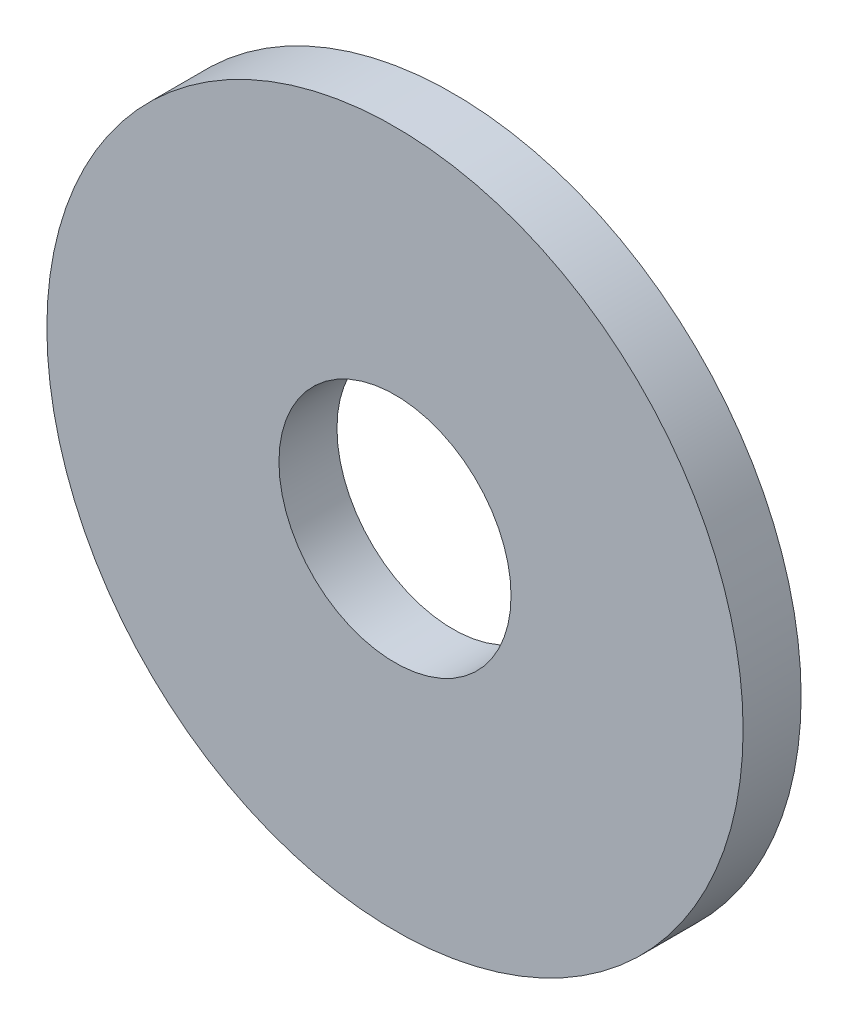
ISO-10303-21;
HEADER;
FILE_DESCRIPTION(('STEP AP214'),'2;1');
FILE_NAME('part.step','',(''),(''),'','','');
FILE_SCHEMA(('AUTOMOTIVE_DESIGN { 1 0 10303 214 1 1 1 1 }'));
ENDSEC;
DATA;
#1=APPLICATION_CONTEXT('core data for automotive mechanical design processes');
#2=APPLICATION_PROTOCOL_DEFINITION('international standard','automotive_design',2000,#1);
#3=PRODUCT_CONTEXT('',#1,'mechanical');
#4=PRODUCT('Part','Part','',(#3));
#5=PRODUCT_RELATED_PRODUCT_CATEGORY('part','',(#4));
#6=PRODUCT_DEFINITION_FORMATION('','',#4);
#7=PRODUCT_DEFINITION_CONTEXT('part definition',#1,'design');
#8=PRODUCT_DEFINITION('design','',#6,#7);
#9=PRODUCT_DEFINITION_SHAPE('','',#8);
#10=(LENGTH_UNIT() NAMED_UNIT(*) SI_UNIT(.MILLI.,.METRE.));
#11=(NAMED_UNIT(*) PLANE_ANGLE_UNIT() SI_UNIT($,.RADIAN.));
#12=(NAMED_UNIT(*) SI_UNIT($,.STERADIAN.) SOLID_ANGLE_UNIT());
#13=UNCERTAINTY_MEASURE_WITH_UNIT(LENGTH_MEASURE(1.E-05),#10,'distance_accuracy_value','');
#14=(GEOMETRIC_REPRESENTATION_CONTEXT(3) GLOBAL_UNCERTAINTY_ASSIGNED_CONTEXT((#13)) GLOBAL_UNIT_ASSIGNED_CONTEXT((#10,
#11,#12)) REPRESENTATION_CONTEXT('',''));
#15=CARTESIAN_POINT('',(0.,0.,0.));
#16=DIRECTION('',(0.,0.,1.));
#17=DIRECTION('',(1.,0.,0.));
#18=AXIS2_PLACEMENT_3D('',#15,#16,#17);
#19=CARTESIAN_POINT('',(0.,0.,1.));
#20=DIRECTION('',(0.,0.,1.));
#21=DIRECTION('',(1.,0.,0.));
#22=AXIS2_PLACEMENT_3D('',#19,#20,#21);
#23=PLANE('',#22);
#24=CARTESIAN_POINT('',(0.,0.,1.));
#25=DIRECTION('',(0.,0.,1.));
#26=DIRECTION('',(1.,0.,0.));
#27=AXIS2_PLACEMENT_3D('',#24,#25,#26);
#28=CIRCLE('',#27,6.);
#29=CARTESIAN_POINT('',(6.,0.,1.));
#30=VERTEX_POINT('',#29);
#31=EDGE_CURVE('E10',#30,#30,#28,.T.);
#32=ORIENTED_EDGE('',*,*,#31,.T.);
#33=EDGE_LOOP('',(#32));
#34=FACE_BOUND('',#33,.T.);
#35=CARTESIAN_POINT('',(0.,0.,1.));
#36=DIRECTION('',(0.,0.,1.));
#37=DIRECTION('',(1.,0.,0.));
#38=AXIS2_PLACEMENT_3D('',#35,#36,#37);
#39=CIRCLE('',#38,2.);
#40=CARTESIAN_POINT('',(2.,0.,1.));
#41=VERTEX_POINT('',#40);
#42=EDGE_CURVE('E42',#41,#41,#39,.T.);
#43=ORIENTED_EDGE('',*,*,#42,.F.);
#44=EDGE_LOOP('',(#43));
#45=FACE_BOUND('',#44,.T.);
#46=ADVANCED_FACE('F31',(#34,#45),#23,.T.);
#47=CARTESIAN_POINT('',(0.,0.,0.));
#48=DIRECTION('',(0.,0.,1.));
#49=DIRECTION('',(1.,0.,0.));
#50=AXIS2_PLACEMENT_3D('',#47,#48,#49);
#51=PLANE('',#50);
#52=CARTESIAN_POINT('',(0.,0.,0.));
#53=DIRECTION('',(0.,0.,1.));
#54=DIRECTION('',(1.,0.,0.));
#55=AXIS2_PLACEMENT_3D('',#52,#53,#54);
#56=CIRCLE('',#55,6.);
#57=CARTESIAN_POINT('',(6.,0.,0.));
#58=VERTEX_POINT('',#57);
#59=EDGE_CURVE('E35',#58,#58,#56,.T.);
#60=ORIENTED_EDGE('',*,*,#59,.F.);
#61=EDGE_LOOP('',(#60));
#62=FACE_BOUND('',#61,.T.);
#63=CARTESIAN_POINT('',(0.,0.,0.));
#64=DIRECTION('',(0.,0.,1.));
#65=DIRECTION('',(1.,0.,0.));
#66=AXIS2_PLACEMENT_3D('',#63,#64,#65);
#67=CIRCLE('',#66,2.);
#68=CARTESIAN_POINT('',(2.,0.,0.));
#69=VERTEX_POINT('',#68);
#70=EDGE_CURVE('E44',#69,#69,#67,.T.);
#71=ORIENTED_EDGE('',*,*,#70,.T.);
#72=EDGE_LOOP('',(#71));
#73=FACE_BOUND('',#72,.T.);
#74=ADVANCED_FACE('F54',(#62,#73),#51,.F.);
#75=CARTESIAN_POINT('',(0.,0.,1.));
#76=DIRECTION('',(0.,0.,-1.));
#77=DIRECTION('',(-1.,0.,0.));
#78=AXIS2_PLACEMENT_3D('',#75,#76,#77);
#79=CYLINDRICAL_SURFACE('',#78,6.);
#80=ORIENTED_EDGE('',*,*,#31,.F.);
#81=EDGE_LOOP('',(#80));
#82=FACE_BOUND('',#81,.T.);
#83=ORIENTED_EDGE('',*,*,#59,.T.);
#84=EDGE_LOOP('',(#83));
#85=FACE_BOUND('',#84,.T.);
#86=ADVANCED_FACE('F33',(#82,#85),#79,.T.);
#87=CARTESIAN_POINT('',(0.,0.,1.));
#88=DIRECTION('',(0.,0.,-1.));
#89=DIRECTION('',(-1.,0.,0.));
#90=AXIS2_PLACEMENT_3D('',#87,#88,#89);
#91=CYLINDRICAL_SURFACE('',#90,2.);
#92=ORIENTED_EDGE('',*,*,#42,.T.);
#93=EDGE_LOOP('',(#92));
#94=FACE_BOUND('',#93,.T.);
#95=ORIENTED_EDGE('',*,*,#70,.F.);
#96=EDGE_LOOP('',(#95));
#97=FACE_BOUND('',#96,.T.);
#98=ADVANCED_FACE('F50',(#94,#97),#91,.F.);
#99=CLOSED_SHELL('',(#46,#74,#86,#98));
#100=MANIFOLD_SOLID_BREP('B2',#99);
#101=ADVANCED_BREP_SHAPE_REPRESENTATION('',(#18,#100),#14);
#102=SHAPE_DEFINITION_REPRESENTATION(#9,#101);
ENDSEC;
END-ISO-10303-21;
